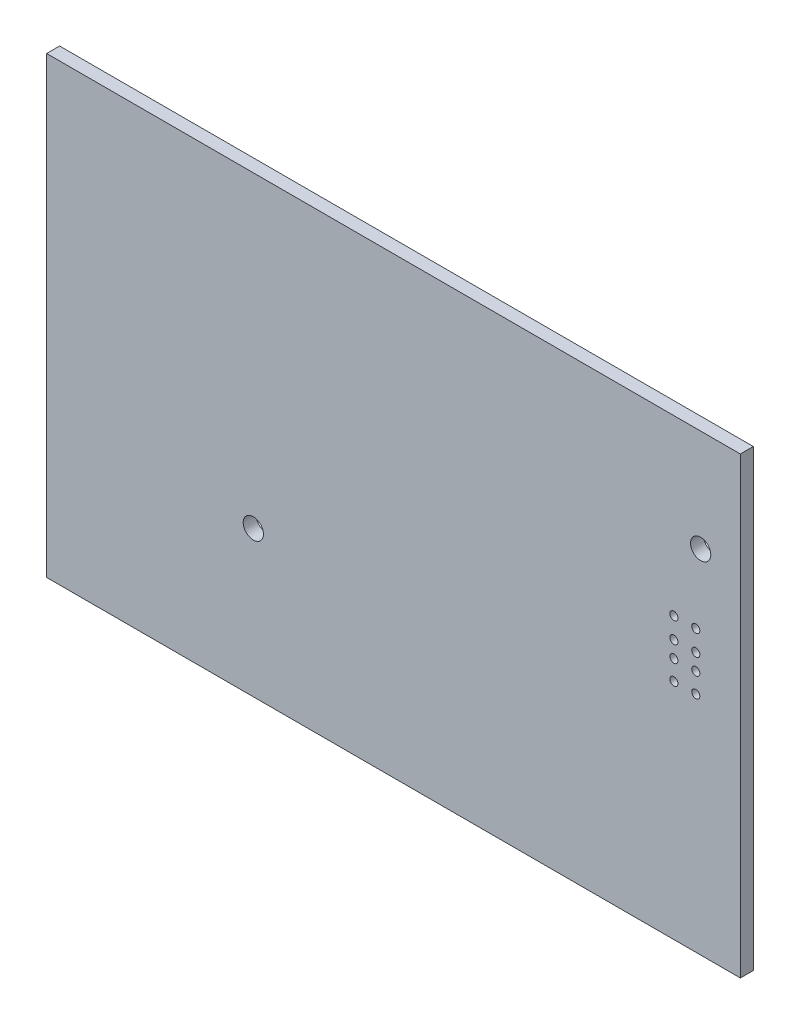
ISO-10303-21;
HEADER;
FILE_DESCRIPTION(('STEP AP214'),'2;1');
FILE_NAME('part.step','',(''),(''),'','','');
FILE_SCHEMA(('AUTOMOTIVE_DESIGN { 1 0 10303 214 1 1 1 1 }'));
ENDSEC;
DATA;
#1=APPLICATION_CONTEXT('core data for automotive mechanical design processes');
#2=APPLICATION_PROTOCOL_DEFINITION('international standard','automotive_design',2000,#1);
#3=PRODUCT_CONTEXT('',#1,'mechanical');
#4=PRODUCT('Part','Part','',(#3));
#5=PRODUCT_RELATED_PRODUCT_CATEGORY('part','',(#4));
#6=PRODUCT_DEFINITION_FORMATION('','',#4);
#7=PRODUCT_DEFINITION_CONTEXT('part definition',#1,'design');
#8=PRODUCT_DEFINITION('design','',#6,#7);
#9=PRODUCT_DEFINITION_SHAPE('','',#8);
#10=(LENGTH_UNIT() NAMED_UNIT(*) SI_UNIT(.MILLI.,.METRE.));
#11=(NAMED_UNIT(*) PLANE_ANGLE_UNIT() SI_UNIT($,.RADIAN.));
#12=(NAMED_UNIT(*) SI_UNIT($,.STERADIAN.) SOLID_ANGLE_UNIT());
#13=UNCERTAINTY_MEASURE_WITH_UNIT(LENGTH_MEASURE(1.E-05),#10,'distance_accuracy_value','');
#14=(GEOMETRIC_REPRESENTATION_CONTEXT(3) GLOBAL_UNCERTAINTY_ASSIGNED_CONTEXT((#13)) GLOBAL_UNIT_ASSIGNED_CONTEXT((#10,
#11,#12)) REPRESENTATION_CONTEXT('',''));
#15=CARTESIAN_POINT('',(0.,0.,0.));
#16=DIRECTION('',(0.,0.,1.));
#17=DIRECTION('',(1.,0.,0.));
#18=AXIS2_PLACEMENT_3D('',#15,#16,#17);
#19=CARTESIAN_POINT('',(0.,0.,1.6));
#20=DIRECTION('',(0.,0.,-1.));
#21=DIRECTION('',(-1.,0.,0.));
#22=AXIS2_PLACEMENT_3D('',#19,#20,#21);
#23=PLANE('',#22);
#24=DIRECTION('',(0.,-1.,0.));
#25=VECTOR('',#24,1.);
#26=CARTESIAN_POINT('',(-43.1,-28.,1.6));
#27=LINE('',#26,#25);
#28=CARTESIAN_POINT('',(-43.1,-28.,1.6));
#29=VERTEX_POINT('',#28);
#30=CARTESIAN_POINT('',(-43.1,28.,1.6));
#31=VERTEX_POINT('',#30);
#32=EDGE_CURVE('E349',#29,#31,#27,.F.);
#33=ORIENTED_EDGE('',*,*,#32,.F.);
#34=DIRECTION('',(1.,0.,0.));
#35=VECTOR('',#34,1.);
#36=CARTESIAN_POINT('',(42.5,-28.,1.6));
#37=LINE('',#36,#35);
#38=CARTESIAN_POINT('',(42.5,-28.,1.6));
#39=VERTEX_POINT('',#38);
#40=EDGE_CURVE('E72',#39,#29,#37,.F.);
#41=ORIENTED_EDGE('',*,*,#40,.F.);
#42=DIRECTION('',(0.,1.,0.));
#43=VECTOR('',#42,1.);
#44=CARTESIAN_POINT('',(42.5,28.,1.6));
#45=LINE('',#44,#43);
#46=CARTESIAN_POINT('',(42.5,28.,1.6));
#47=VERTEX_POINT('',#46);
#48=EDGE_CURVE('E55',#47,#39,#45,.F.);
#49=ORIENTED_EDGE('',*,*,#48,.F.);
#50=DIRECTION('',(-1.,0.,0.));
#51=VECTOR('',#50,1.);
#52=CARTESIAN_POINT('',(-43.1,28.,1.6));
#53=LINE('',#52,#51);
#54=EDGE_CURVE('E60',#31,#47,#53,.F.);
#55=ORIENTED_EDGE('',*,*,#54,.F.);
#56=EDGE_LOOP('',(#33,#41,#49,#55));
#57=FACE_BOUND('',#56,.T.);
#58=CARTESIAN_POINT('',(37.,6.6,1.6));
#59=DIRECTION('',(0.,0.,1.));
#60=DIRECTION('',(1.,0.,0.));
#61=AXIS2_PLACEMENT_3D('',#58,#59,#60);
#62=CIRCLE('',#61,0.5);
#63=CARTESIAN_POINT('',(37.5,6.6,1.6));
#64=VERTEX_POINT('',#63);
#65=EDGE_CURVE('E69',#64,#64,#62,.F.);
#66=ORIENTED_EDGE('',*,*,#65,.T.);
#67=EDGE_LOOP('',(#66));
#68=FACE_BOUND('',#67,.T.);
#69=CARTESIAN_POINT('',(34.3,6.6,1.6));
#70=DIRECTION('',(0.,0.,1.));
#71=DIRECTION('',(1.,0.,0.));
#72=AXIS2_PLACEMENT_3D('',#69,#70,#71);
#73=CIRCLE('',#72,0.5);
#74=CARTESIAN_POINT('',(34.8,6.6,1.6));
#75=VERTEX_POINT('',#74);
#76=EDGE_CURVE('E116',#75,#75,#73,.F.);
#77=ORIENTED_EDGE('',*,*,#76,.T.);
#78=EDGE_LOOP('',(#77));
#79=FACE_BOUND('',#78,.T.);
#80=CARTESIAN_POINT('',(34.3,4.05,1.6));
#81=DIRECTION('',(0.,0.,1.));
#82=DIRECTION('',(1.,0.,0.));
#83=AXIS2_PLACEMENT_3D('',#80,#81,#82);
#84=CIRCLE('',#83,0.5);
#85=CARTESIAN_POINT('',(34.8,4.05,1.6));
#86=VERTEX_POINT('',#85);
#87=EDGE_CURVE('E119',#86,#86,#84,.F.);
#88=ORIENTED_EDGE('',*,*,#87,.T.);
#89=EDGE_LOOP('',(#88));
#90=FACE_BOUND('',#89,.T.);
#91=CARTESIAN_POINT('',(34.3,2.04,1.6));
#92=DIRECTION('',(0.,0.,1.));
#93=DIRECTION('',(1.,0.,0.));
#94=AXIS2_PLACEMENT_3D('',#91,#92,#93);
#95=CIRCLE('',#94,0.5);
#96=CARTESIAN_POINT('',(34.8,2.04,1.6));
#97=VERTEX_POINT('',#96);
#98=EDGE_CURVE('E122',#97,#97,#95,.F.);
#99=ORIENTED_EDGE('',*,*,#98,.T.);
#100=EDGE_LOOP('',(#99));
#101=FACE_BOUND('',#100,.T.);
#102=CARTESIAN_POINT('',(34.3,-0.4,1.6));
#103=DIRECTION('',(0.,0.,1.));
#104=DIRECTION('',(1.,0.,0.));
#105=AXIS2_PLACEMENT_3D('',#102,#103,#104);
#106=CIRCLE('',#105,0.5);
#107=CARTESIAN_POINT('',(34.8,-0.4,1.6));
#108=VERTEX_POINT('',#107);
#109=EDGE_CURVE('E125',#108,#108,#106,.F.);
#110=ORIENTED_EDGE('',*,*,#109,.T.);
#111=EDGE_LOOP('',(#110));
#112=FACE_BOUND('',#111,.T.);
#113=CARTESIAN_POINT('',(37.,4.05,1.6));
#114=DIRECTION('',(0.,0.,1.));
#115=DIRECTION('',(1.,0.,0.));
#116=AXIS2_PLACEMENT_3D('',#113,#114,#115);
#117=CIRCLE('',#116,0.5);
#118=CARTESIAN_POINT('',(37.5,4.05,1.6));
#119=VERTEX_POINT('',#118);
#120=EDGE_CURVE('E128',#119,#119,#117,.F.);
#121=ORIENTED_EDGE('',*,*,#120,.T.);
#122=EDGE_LOOP('',(#121));
#123=FACE_BOUND('',#122,.T.);
#124=CARTESIAN_POINT('',(37.,2.04,1.6));
#125=DIRECTION('',(0.,0.,1.));
#126=DIRECTION('',(1.,0.,0.));
#127=AXIS2_PLACEMENT_3D('',#124,#125,#126);
#128=CIRCLE('',#127,0.5);
#129=CARTESIAN_POINT('',(37.5,2.04,1.6));
#130=VERTEX_POINT('',#129);
#131=EDGE_CURVE('E131',#130,#130,#128,.F.);
#132=ORIENTED_EDGE('',*,*,#131,.T.);
#133=EDGE_LOOP('',(#132));
#134=FACE_BOUND('',#133,.T.);
#135=CARTESIAN_POINT('',(37.,-0.4,1.6));
#136=DIRECTION('',(0.,0.,1.));
#137=DIRECTION('',(1.,0.,0.));
#138=AXIS2_PLACEMENT_3D('',#135,#136,#137);
#139=CIRCLE('',#138,0.5);
#140=CARTESIAN_POINT('',(37.5,-0.4,1.6));
#141=VERTEX_POINT('',#140);
#142=EDGE_CURVE('E134',#141,#141,#139,.F.);
#143=ORIENTED_EDGE('',*,*,#142,.T.);
#144=EDGE_LOOP('',(#143));
#145=FACE_BOUND('',#144,.T.);
#146=CARTESIAN_POINT('',(37.6,15.4,1.6));
#147=DIRECTION('',(0.,0.,1.));
#148=DIRECTION('',(1.,0.,0.));
#149=AXIS2_PLACEMENT_3D('',#146,#147,#148);
#150=CIRCLE('',#149,1.25000000000001);
#151=CARTESIAN_POINT('',(38.85,15.4,1.6));
#152=VERTEX_POINT('',#151);
#153=EDGE_CURVE('E136',#152,#152,#150,.F.);
#154=ORIENTED_EDGE('',*,*,#153,.T.);
#155=EDGE_LOOP('',(#154));
#156=FACE_BOUND('',#155,.T.);
#157=CARTESIAN_POINT('',(-17.6,-10.,1.6));
#158=DIRECTION('',(0.,0.,1.));
#159=DIRECTION('',(1.,0.,0.));
#160=AXIS2_PLACEMENT_3D('',#157,#158,#159);
#161=CIRCLE('',#160,1.25);
#162=CARTESIAN_POINT('',(-16.35,-10.,1.6));
#163=VERTEX_POINT('',#162);
#164=EDGE_CURVE('E20',#163,#163,#161,.F.);
#165=ORIENTED_EDGE('',*,*,#164,.T.);
#166=EDGE_LOOP('',(#165));
#167=FACE_BOUND('',#166,.T.);
#168=ADVANCED_FACE('F17',(#57,#68,#79,#90,#101,#112,#123,#134,#145,#156,#167),#23,.F.);
#169=CARTESIAN_POINT('',(-17.6,-10.,-8.4));
#170=DIRECTION('',(0.,0.,1.));
#171=DIRECTION('',(1.,0.,0.));
#172=AXIS2_PLACEMENT_3D('',#169,#170,#171);
#173=CYLINDRICAL_SURFACE('',#172,1.25);
#174=CARTESIAN_POINT('',(-17.6,-10.,0.));
#175=DIRECTION('',(0.,0.,1.));
#176=DIRECTION('',(1.,0.,0.));
#177=AXIS2_PLACEMENT_3D('',#174,#175,#176);
#178=CIRCLE('',#177,1.25);
#179=CARTESIAN_POINT('',(-16.35,-10.,0.));
#180=VERTEX_POINT('',#179);
#181=EDGE_CURVE('E111',#180,#180,#178,.T.);
#182=ORIENTED_EDGE('',*,*,#181,.F.);
#183=EDGE_LOOP('',(#182));
#184=FACE_BOUND('',#183,.T.);
#185=ORIENTED_EDGE('',*,*,#164,.F.);
#186=EDGE_LOOP('',(#185));
#187=FACE_BOUND('',#186,.T.);
#188=ADVANCED_FACE('F144',(#184,#187),#173,.F.);
#189=CARTESIAN_POINT('',(37.6,15.4,-8.4));
#190=DIRECTION('',(0.,0.,1.));
#191=DIRECTION('',(1.,0.,0.));
#192=AXIS2_PLACEMENT_3D('',#189,#190,#191);
#193=CYLINDRICAL_SURFACE('',#192,1.25000000000001);
#194=CARTESIAN_POINT('',(37.6,15.4,0.));
#195=DIRECTION('',(0.,0.,1.));
#196=DIRECTION('',(1.,0.,0.));
#197=AXIS2_PLACEMENT_3D('',#194,#195,#196);
#198=CIRCLE('',#197,1.25000000000001);
#199=CARTESIAN_POINT('',(38.85,15.4,0.));
#200=VERTEX_POINT('',#199);
#201=EDGE_CURVE('E108',#200,#200,#198,.T.);
#202=ORIENTED_EDGE('',*,*,#201,.F.);
#203=EDGE_LOOP('',(#202));
#204=FACE_BOUND('',#203,.T.);
#205=ORIENTED_EDGE('',*,*,#153,.F.);
#206=EDGE_LOOP('',(#205));
#207=FACE_BOUND('',#206,.T.);
#208=ADVANCED_FACE('F146',(#204,#207),#193,.F.);
#209=CARTESIAN_POINT('',(37.,-0.4,-0.4));
#210=DIRECTION('',(0.,0.,1.));
#211=DIRECTION('',(1.,0.,0.));
#212=AXIS2_PLACEMENT_3D('',#209,#210,#211);
#213=CYLINDRICAL_SURFACE('',#212,0.5);
#214=CARTESIAN_POINT('',(37.,-0.4,0.));
#215=DIRECTION('',(0.,0.,1.));
#216=DIRECTION('',(1.,0.,0.));
#217=AXIS2_PLACEMENT_3D('',#214,#215,#216);
#218=CIRCLE('',#217,0.5);
#219=CARTESIAN_POINT('',(37.5,-0.4,0.));
#220=VERTEX_POINT('',#219);
#221=EDGE_CURVE('E105',#220,#220,#218,.T.);
#222=ORIENTED_EDGE('',*,*,#221,.F.);
#223=EDGE_LOOP('',(#222));
#224=FACE_BOUND('',#223,.T.);
#225=ORIENTED_EDGE('',*,*,#142,.F.);
#226=EDGE_LOOP('',(#225));
#227=FACE_BOUND('',#226,.T.);
#228=ADVANCED_FACE('F153',(#224,#227),#213,.F.);
#229=CARTESIAN_POINT('',(37.,2.04,-0.4));
#230=DIRECTION('',(0.,0.,1.));
#231=DIRECTION('',(1.,0.,0.));
#232=AXIS2_PLACEMENT_3D('',#229,#230,#231);
#233=CYLINDRICAL_SURFACE('',#232,0.5);
#234=CARTESIAN_POINT('',(37.,2.04,0.));
#235=DIRECTION('',(0.,0.,1.));
#236=DIRECTION('',(1.,0.,0.));
#237=AXIS2_PLACEMENT_3D('',#234,#235,#236);
#238=CIRCLE('',#237,0.5);
#239=CARTESIAN_POINT('',(37.5,2.04,0.));
#240=VERTEX_POINT('',#239);
#241=EDGE_CURVE('E102',#240,#240,#238,.T.);
#242=ORIENTED_EDGE('',*,*,#241,.F.);
#243=EDGE_LOOP('',(#242));
#244=FACE_BOUND('',#243,.T.);
#245=ORIENTED_EDGE('',*,*,#131,.F.);
#246=EDGE_LOOP('',(#245));
#247=FACE_BOUND('',#246,.T.);
#248=ADVANCED_FACE('F200',(#244,#247),#233,.F.);
#249=CARTESIAN_POINT('',(37.,4.05,-0.4));
#250=DIRECTION('',(0.,0.,1.));
#251=DIRECTION('',(1.,0.,0.));
#252=AXIS2_PLACEMENT_3D('',#249,#250,#251);
#253=CYLINDRICAL_SURFACE('',#252,0.5);
#254=CARTESIAN_POINT('',(37.,4.05,0.));
#255=DIRECTION('',(0.,0.,1.));
#256=DIRECTION('',(1.,0.,0.));
#257=AXIS2_PLACEMENT_3D('',#254,#255,#256);
#258=CIRCLE('',#257,0.5);
#259=CARTESIAN_POINT('',(37.5,4.05,0.));
#260=VERTEX_POINT('',#259);
#261=EDGE_CURVE('E99',#260,#260,#258,.T.);
#262=ORIENTED_EDGE('',*,*,#261,.F.);
#263=EDGE_LOOP('',(#262));
#264=FACE_BOUND('',#263,.T.);
#265=ORIENTED_EDGE('',*,*,#120,.F.);
#266=EDGE_LOOP('',(#265));
#267=FACE_BOUND('',#266,.T.);
#268=ADVANCED_FACE('F196',(#264,#267),#253,.F.);
#269=CARTESIAN_POINT('',(34.3,-0.4,-0.4));
#270=DIRECTION('',(0.,0.,1.));
#271=DIRECTION('',(1.,0.,0.));
#272=AXIS2_PLACEMENT_3D('',#269,#270,#271);
#273=CYLINDRICAL_SURFACE('',#272,0.5);
#274=CARTESIAN_POINT('',(34.3,-0.4,0.));
#275=DIRECTION('',(0.,0.,1.));
#276=DIRECTION('',(1.,0.,0.));
#277=AXIS2_PLACEMENT_3D('',#274,#275,#276);
#278=CIRCLE('',#277,0.5);
#279=CARTESIAN_POINT('',(34.8,-0.4,0.));
#280=VERTEX_POINT('',#279);
#281=EDGE_CURVE('E96',#280,#280,#278,.T.);
#282=ORIENTED_EDGE('',*,*,#281,.F.);
#283=EDGE_LOOP('',(#282));
#284=FACE_BOUND('',#283,.T.);
#285=ORIENTED_EDGE('',*,*,#109,.F.);
#286=EDGE_LOOP('',(#285));
#287=FACE_BOUND('',#286,.T.);
#288=ADVANCED_FACE('F192',(#284,#287),#273,.F.);
#289=CARTESIAN_POINT('',(34.3,2.04,-0.4));
#290=DIRECTION('',(0.,0.,1.));
#291=DIRECTION('',(1.,0.,0.));
#292=AXIS2_PLACEMENT_3D('',#289,#290,#291);
#293=CYLINDRICAL_SURFACE('',#292,0.5);
#294=CARTESIAN_POINT('',(34.3,2.04,0.));
#295=DIRECTION('',(0.,0.,1.));
#296=DIRECTION('',(1.,0.,0.));
#297=AXIS2_PLACEMENT_3D('',#294,#295,#296);
#298=CIRCLE('',#297,0.5);
#299=CARTESIAN_POINT('',(34.8,2.04,0.));
#300=VERTEX_POINT('',#299);
#301=EDGE_CURVE('E93',#300,#300,#298,.T.);
#302=ORIENTED_EDGE('',*,*,#301,.F.);
#303=EDGE_LOOP('',(#302));
#304=FACE_BOUND('',#303,.T.);
#305=ORIENTED_EDGE('',*,*,#98,.F.);
#306=EDGE_LOOP('',(#305));
#307=FACE_BOUND('',#306,.T.);
#308=ADVANCED_FACE('F188',(#304,#307),#293,.F.);
#309=CARTESIAN_POINT('',(34.3,4.05,-0.4));
#310=DIRECTION('',(0.,0.,1.));
#311=DIRECTION('',(1.,0.,0.));
#312=AXIS2_PLACEMENT_3D('',#309,#310,#311);
#313=CYLINDRICAL_SURFACE('',#312,0.5);
#314=CARTESIAN_POINT('',(34.3,4.05,0.));
#315=DIRECTION('',(0.,0.,1.));
#316=DIRECTION('',(1.,0.,0.));
#317=AXIS2_PLACEMENT_3D('',#314,#315,#316);
#318=CIRCLE('',#317,0.5);
#319=CARTESIAN_POINT('',(34.8,4.05,0.));
#320=VERTEX_POINT('',#319);
#321=EDGE_CURVE('E90',#320,#320,#318,.T.);
#322=ORIENTED_EDGE('',*,*,#321,.F.);
#323=EDGE_LOOP('',(#322));
#324=FACE_BOUND('',#323,.T.);
#325=ORIENTED_EDGE('',*,*,#87,.F.);
#326=EDGE_LOOP('',(#325));
#327=FACE_BOUND('',#326,.T.);
#328=ADVANCED_FACE('F184',(#324,#327),#313,.F.);
#329=CARTESIAN_POINT('',(34.3,6.6,-0.4));
#330=DIRECTION('',(0.,0.,1.));
#331=DIRECTION('',(1.,0.,0.));
#332=AXIS2_PLACEMENT_3D('',#329,#330,#331);
#333=CYLINDRICAL_SURFACE('',#332,0.5);
#334=CARTESIAN_POINT('',(34.3,6.6,0.));
#335=DIRECTION('',(0.,0.,1.));
#336=DIRECTION('',(1.,0.,0.));
#337=AXIS2_PLACEMENT_3D('',#334,#335,#336);
#338=CIRCLE('',#337,0.5);
#339=CARTESIAN_POINT('',(34.8,6.6,0.));
#340=VERTEX_POINT('',#339);
#341=EDGE_CURVE('E87',#340,#340,#338,.T.);
#342=ORIENTED_EDGE('',*,*,#341,.F.);
#343=EDGE_LOOP('',(#342));
#344=FACE_BOUND('',#343,.T.);
#345=ORIENTED_EDGE('',*,*,#76,.F.);
#346=EDGE_LOOP('',(#345));
#347=FACE_BOUND('',#346,.T.);
#348=ADVANCED_FACE('F180',(#344,#347),#333,.F.);
#349=CARTESIAN_POINT('',(37.,6.6,-0.4));
#350=DIRECTION('',(0.,0.,1.));
#351=DIRECTION('',(1.,0.,0.));
#352=AXIS2_PLACEMENT_3D('',#349,#350,#351);
#353=CYLINDRICAL_SURFACE('',#352,0.5);
#354=CARTESIAN_POINT('',(37.,6.6,0.));
#355=DIRECTION('',(0.,0.,1.));
#356=DIRECTION('',(1.,0.,0.));
#357=AXIS2_PLACEMENT_3D('',#354,#355,#356);
#358=CIRCLE('',#357,0.5);
#359=CARTESIAN_POINT('',(37.5,6.6,0.));
#360=VERTEX_POINT('',#359);
#361=EDGE_CURVE('E83',#360,#360,#358,.T.);
#362=ORIENTED_EDGE('',*,*,#361,.F.);
#363=EDGE_LOOP('',(#362));
#364=FACE_BOUND('',#363,.T.);
#365=ORIENTED_EDGE('',*,*,#65,.F.);
#366=EDGE_LOOP('',(#365));
#367=FACE_BOUND('',#366,.T.);
#368=ADVANCED_FACE('F177',(#364,#367),#353,.F.);
#369=CARTESIAN_POINT('',(-43.1,28.,1.6));
#370=DIRECTION('',(0.,1.,0.));
#371=DIRECTION('',(-1.,0.,0.));
#372=AXIS2_PLACEMENT_3D('',#369,#370,#371);
#373=PLANE('',#372);
#374=ORIENTED_EDGE('',*,*,#54,.T.);
#375=DIRECTION('',(0.,0.,-1.));
#376=VECTOR('',#375,1.);
#377=CARTESIAN_POINT('',(42.5,28.,1.6));
#378=LINE('',#377,#376);
#379=CARTESIAN_POINT('',(42.5,28.,0.));
#380=VERTEX_POINT('',#379);
#381=EDGE_CURVE('E62',#380,#47,#378,.F.);
#382=ORIENTED_EDGE('',*,*,#381,.F.);
#383=DIRECTION('',(-1.,0.,0.));
#384=VECTOR('',#383,1.);
#385=CARTESIAN_POINT('',(0.,28.,0.));
#386=LINE('',#385,#384);
#387=CARTESIAN_POINT('',(-43.1,28.,0.));
#388=VERTEX_POINT('',#387);
#389=EDGE_CURVE('E86',#388,#380,#386,.F.);
#390=ORIENTED_EDGE('',*,*,#389,.F.);
#391=DIRECTION('',(0.,0.,1.));
#392=VECTOR('',#391,1.);
#393=CARTESIAN_POINT('',(-43.1,28.,1.6));
#394=LINE('',#393,#392);
#395=EDGE_CURVE('E65',#31,#388,#394,.F.);
#396=ORIENTED_EDGE('',*,*,#395,.F.);
#397=EDGE_LOOP('',(#374,#382,#390,#396));
#398=FACE_BOUND('',#397,.T.);
#399=ADVANCED_FACE('F61',(#398),#373,.T.);
#400=CARTESIAN_POINT('',(42.5,28.,1.6));
#401=DIRECTION('',(1.,0.,0.));
#402=DIRECTION('',(0.,0.,-1.));
#403=AXIS2_PLACEMENT_3D('',#400,#401,#402);
#404=PLANE('',#403);
#405=ORIENTED_EDGE('',*,*,#48,.T.);
#406=DIRECTION('',(0.,0.,-1.));
#407=VECTOR('',#406,1.);
#408=CARTESIAN_POINT('',(42.5,-28.,1.6));
#409=LINE('',#408,#407);
#410=CARTESIAN_POINT('',(42.5,-28.,0.));
#411=VERTEX_POINT('',#410);
#412=EDGE_CURVE('E74',#411,#39,#409,.F.);
#413=ORIENTED_EDGE('',*,*,#412,.F.);
#414=DIRECTION('',(0.,1.,0.));
#415=VECTOR('',#414,1.);
#416=CARTESIAN_POINT('',(42.5,0.,0.));
#417=LINE('',#416,#415);
#418=EDGE_CURVE('E78',#380,#411,#417,.F.);
#419=ORIENTED_EDGE('',*,*,#418,.F.);
#420=ORIENTED_EDGE('',*,*,#381,.T.);
#421=EDGE_LOOP('',(#405,#413,#419,#420));
#422=FACE_BOUND('',#421,.T.);
#423=ADVANCED_FACE('F76',(#422),#404,.T.);
#424=CARTESIAN_POINT('',(42.5,-28.,1.6));
#425=DIRECTION('',(0.,-1.,0.));
#426=DIRECTION('',(0.,0.,-1.));
#427=AXIS2_PLACEMENT_3D('',#424,#425,#426);
#428=PLANE('',#427);
#429=ORIENTED_EDGE('',*,*,#40,.T.);
#430=DIRECTION('',(0.,0.,1.));
#431=VECTOR('',#430,1.);
#432=CARTESIAN_POINT('',(-43.1,-28.,1.6));
#433=LINE('',#432,#431);
#434=CARTESIAN_POINT('',(-43.1,-28.,0.));
#435=VERTEX_POINT('',#434);
#436=EDGE_CURVE('E35',#435,#29,#433,.T.);
#437=ORIENTED_EDGE('',*,*,#436,.F.);
#438=DIRECTION('',(-1.,0.,0.));
#439=VECTOR('',#438,1.);
#440=CARTESIAN_POINT('',(0.,-28.,0.));
#441=LINE('',#440,#439);
#442=EDGE_CURVE('E26',#411,#435,#441,.T.);
#443=ORIENTED_EDGE('',*,*,#442,.F.);
#444=ORIENTED_EDGE('',*,*,#412,.T.);
#445=EDGE_LOOP('',(#429,#437,#443,#444));
#446=FACE_BOUND('',#445,.T.);
#447=ADVANCED_FACE('F165',(#446),#428,.T.);
#448=CARTESIAN_POINT('',(-43.1,-28.,1.6));
#449=DIRECTION('',(-1.,0.,0.));
#450=DIRECTION('',(0.,-1.,0.));
#451=AXIS2_PLACEMENT_3D('',#448,#449,#450);
#452=PLANE('',#451);
#453=ORIENTED_EDGE('',*,*,#32,.T.);
#454=ORIENTED_EDGE('',*,*,#395,.T.);
#455=DIRECTION('',(0.,1.,0.));
#456=VECTOR('',#455,1.);
#457=CARTESIAN_POINT('',(-43.1,0.,0.));
#458=LINE('',#457,#456);
#459=EDGE_CURVE('E11',#435,#388,#458,.T.);
#460=ORIENTED_EDGE('',*,*,#459,.F.);
#461=ORIENTED_EDGE('',*,*,#436,.T.);
#462=EDGE_LOOP('',(#453,#454,#460,#461));
#463=FACE_BOUND('',#462,.T.);
#464=ADVANCED_FACE('F159',(#463),#452,.T.);
#465=CARTESIAN_POINT('',(0.,0.,0.));
#466=DIRECTION('',(0.,0.,-1.));
#467=DIRECTION('',(-1.,0.,0.));
#468=AXIS2_PLACEMENT_3D('',#465,#466,#467);
#469=PLANE('',#468);
#470=ORIENTED_EDGE('',*,*,#442,.T.);
#471=ORIENTED_EDGE('',*,*,#459,.T.);
#472=ORIENTED_EDGE('',*,*,#389,.T.);
#473=ORIENTED_EDGE('',*,*,#418,.T.);
#474=EDGE_LOOP('',(#470,#471,#472,#473));
#475=FACE_BOUND('',#474,.T.);
#476=ORIENTED_EDGE('',*,*,#361,.T.);
#477=EDGE_LOOP('',(#476));
#478=FACE_BOUND('',#477,.T.);
#479=ORIENTED_EDGE('',*,*,#341,.T.);
#480=EDGE_LOOP('',(#479));
#481=FACE_BOUND('',#480,.T.);
#482=ORIENTED_EDGE('',*,*,#321,.T.);
#483=EDGE_LOOP('',(#482));
#484=FACE_BOUND('',#483,.T.);
#485=ORIENTED_EDGE('',*,*,#301,.T.);
#486=EDGE_LOOP('',(#485));
#487=FACE_BOUND('',#486,.T.);
#488=ORIENTED_EDGE('',*,*,#281,.T.);
#489=EDGE_LOOP('',(#488));
#490=FACE_BOUND('',#489,.T.);
#491=ORIENTED_EDGE('',*,*,#261,.T.);
#492=EDGE_LOOP('',(#491));
#493=FACE_BOUND('',#492,.T.);
#494=ORIENTED_EDGE('',*,*,#241,.T.);
#495=EDGE_LOOP('',(#494));
#496=FACE_BOUND('',#495,.T.);
#497=ORIENTED_EDGE('',*,*,#221,.T.);
#498=EDGE_LOOP('',(#497));
#499=FACE_BOUND('',#498,.T.);
#500=ORIENTED_EDGE('',*,*,#201,.T.);
#501=EDGE_LOOP('',(#500));
#502=FACE_BOUND('',#501,.T.);
#503=ORIENTED_EDGE('',*,*,#181,.T.);
#504=EDGE_LOOP('',(#503));
#505=FACE_BOUND('',#504,.T.);
#506=ADVANCED_FACE('F157',(#475,#478,#481,#484,#487,#490,#493,#496,#499,#502,#505),#469,.T.);
#507=CLOSED_SHELL('',(#168,#188,#208,#228,#248,#268,#288,#308,#328,#348,#368,#399,#423,#447,
#464,#506));
#508=MANIFOLD_SOLID_BREP('B1',#507);
#509=ADVANCED_BREP_SHAPE_REPRESENTATION('',(#18,#508),#14);
#510=SHAPE_DEFINITION_REPRESENTATION(#9,#509);
ENDSEC;
END-ISO-10303-21;
